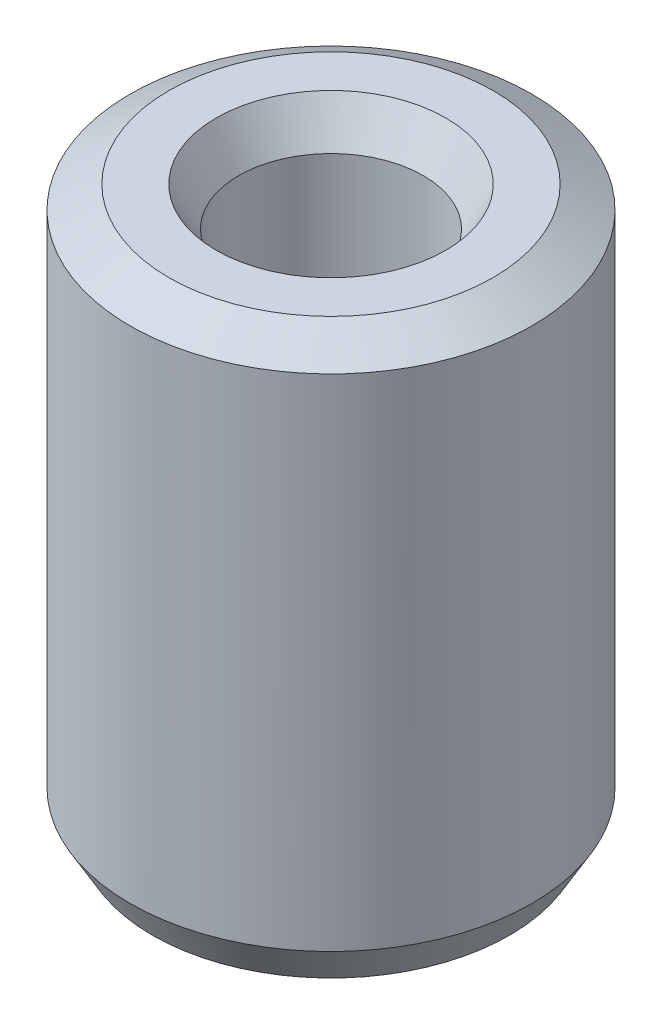
ISO-10303-21;
HEADER;
FILE_DESCRIPTION(('STEP AP214'),'2;1');
FILE_NAME('part.step','',(''),(''),'','','');
FILE_SCHEMA(('AUTOMOTIVE_DESIGN { 1 0 10303 214 1 1 1 1 }'));
ENDSEC;
DATA;
#1=APPLICATION_CONTEXT('core data for automotive mechanical design processes');
#2=APPLICATION_PROTOCOL_DEFINITION('international standard','automotive_design',2000,#1);
#3=PRODUCT_CONTEXT('',#1,'mechanical');
#4=PRODUCT('Part','Part','',(#3));
#5=PRODUCT_RELATED_PRODUCT_CATEGORY('part','',(#4));
#6=PRODUCT_DEFINITION_FORMATION('','',#4);
#7=PRODUCT_DEFINITION_CONTEXT('part definition',#1,'design');
#8=PRODUCT_DEFINITION('design','',#6,#7);
#9=PRODUCT_DEFINITION_SHAPE('','',#8);
#10=(LENGTH_UNIT() NAMED_UNIT(*) SI_UNIT(.MILLI.,.METRE.));
#11=(NAMED_UNIT(*) PLANE_ANGLE_UNIT() SI_UNIT($,.RADIAN.));
#12=(NAMED_UNIT(*) SI_UNIT($,.STERADIAN.) SOLID_ANGLE_UNIT());
#13=UNCERTAINTY_MEASURE_WITH_UNIT(LENGTH_MEASURE(1.E-05),#10,'distance_accuracy_value','');
#14=(GEOMETRIC_REPRESENTATION_CONTEXT(3) GLOBAL_UNCERTAINTY_ASSIGNED_CONTEXT((#13)) GLOBAL_UNIT_ASSIGNED_CONTEXT((#10,
#11,#12)) REPRESENTATION_CONTEXT('',''));
#15=CARTESIAN_POINT('',(0.,0.,0.));
#16=DIRECTION('',(0.,0.,1.));
#17=DIRECTION('',(1.,0.,0.));
#18=AXIS2_PLACEMENT_3D('',#15,#16,#17);
#19=CARTESIAN_POINT('',(0.,55.9058764466057,0.));
#20=DIRECTION('',(0.,-1.,0.));
#21=DIRECTION('',(0.,0.,-1.));
#22=AXIS2_PLACEMENT_3D('',#19,#20,#21);
#23=CYLINDRICAL_SURFACE('',#22,20.);
#24=CARTESIAN_POINT('',(0.,3.86379041157737,0.));
#25=DIRECTION('',(0.,1.,0.));
#26=DIRECTION('',(0.,0.,1.));
#27=AXIS2_PLACEMENT_3D('',#24,#25,#26);
#28=CIRCLE('',#27,20.);
#29=CARTESIAN_POINT('',(0.,3.86379041157737,-20.));
#30=VERTEX_POINT('',#29);
#31=EDGE_CURVE('E10',#30,#30,#28,.T.);
#32=CARTESIAN_POINT('',(0.,53.6751160123893,0.));
#33=DIRECTION('',(0.,1.,0.));
#34=DIRECTION('',(0.,0.,1.));
#35=AXIS2_PLACEMENT_3D('',#32,#33,#34);
#36=CIRCLE('',#35,20.);
#37=CARTESIAN_POINT('',(0.,53.6751160123893,-20.));
#38=VERTEX_POINT('',#37);
#39=EDGE_CURVE('E50',#38,#38,#36,.F.);
#40=CARTESIAN_POINT('',(0.,3.86379041157737,-20.));
#41=CARTESIAN_POINT('',(0.,4.38265838658582,-20.));
#42=CARTESIAN_POINT('',(0.,4.90152636159428,-20.));
#43=CARTESIAN_POINT('',(0.,5.9392623116112,-20.));
#44=CARTESIAN_POINT('',(0.,6.45813028661966,-20.));
#45=CARTESIAN_POINT('',(0.,7.49586623663657,-20.));
#46=CARTESIAN_POINT('',(0.,8.01473421164503,-20.));
#47=CARTESIAN_POINT('',(0.,9.05247016166194,-20.));
#48=CARTESIAN_POINT('',(0.,9.5713381366704,-20.));
#49=CARTESIAN_POINT('',(0.,10.6090740866873,-20.));
#50=CARTESIAN_POINT('',(0.,11.1279420616958,-20.));
#51=CARTESIAN_POINT('',(0.,12.1656780117127,-20.));
#52=CARTESIAN_POINT('',(0.,12.6845459867211,-20.));
#53=CARTESIAN_POINT('',(0.,13.7222819367381,-20.));
#54=CARTESIAN_POINT('',(0.,14.2411499117465,-20.));
#55=CARTESIAN_POINT('',(0.,15.2788858617634,-20.));
#56=CARTESIAN_POINT('',(0.,15.7977538367719,-20.));
#57=CARTESIAN_POINT('',(0.,16.8354897867888,-20.));
#58=CARTESIAN_POINT('',(0.,17.3543577617973,-20.));
#59=CARTESIAN_POINT('',(0.,18.3920937118142,-20.));
#60=CARTESIAN_POINT('',(0.,18.9109616868226,-20.));
#61=CARTESIAN_POINT('',(0.,19.9486976368395,-20.));
#62=CARTESIAN_POINT('',(0.,20.467565611848,-20.));
#63=CARTESIAN_POINT('',(0.,21.5053015618649,-20.));
#64=CARTESIAN_POINT('',(0.,22.0241695368734,-20.));
#65=CARTESIAN_POINT('',(0.,23.0619054868903,-20.));
#66=CARTESIAN_POINT('',(0.,23.5807734618987,-20.));
#67=CARTESIAN_POINT('',(0.,24.6185094119157,-20.));
#68=CARTESIAN_POINT('',(0.,25.1373773869241,-20.));
#69=CARTESIAN_POINT('',(0.,26.175113336941,-20.));
#70=CARTESIAN_POINT('',(0.,26.6939813119495,-20.));
#71=CARTESIAN_POINT('',(0.,27.7317172619664,-20.));
#72=CARTESIAN_POINT('',(0.,28.2505852369748,-20.));
#73=CARTESIAN_POINT('',(0.,29.2883211869918,-20.));
#74=CARTESIAN_POINT('',(0.,29.8071891620002,-20.));
#75=CARTESIAN_POINT('',(0.,30.8449251120171,-20.));
#76=CARTESIAN_POINT('',(0.,31.3637930870256,-20.));
#77=CARTESIAN_POINT('',(0.,32.4015290370425,-20.));
#78=CARTESIAN_POINT('',(0.,32.920397012051,-20.));
#79=CARTESIAN_POINT('',(0.,33.9581329620679,-20.));
#80=CARTESIAN_POINT('',(0.,34.4770009370763,-20.));
#81=CARTESIAN_POINT('',(0.,35.5147368870932,-20.));
#82=CARTESIAN_POINT('',(0.,36.0336048621017,-20.));
#83=CARTESIAN_POINT('',(0.,37.0713408121186,-20.));
#84=CARTESIAN_POINT('',(0.,37.5902087871271,-20.));
#85=CARTESIAN_POINT('',(0.,38.627944737144,-20.));
#86=CARTESIAN_POINT('',(0.,39.1468127121525,-20.));
#87=CARTESIAN_POINT('',(0.,40.1845486621694,-20.));
#88=CARTESIAN_POINT('',(0.,40.7034166371778,-20.));
#89=CARTESIAN_POINT('',(0.,41.7411525871947,-20.));
#90=CARTESIAN_POINT('',(0.,42.2600205622032,-20.));
#91=CARTESIAN_POINT('',(0.,43.2977565122201,-20.));
#92=CARTESIAN_POINT('',(0.,43.8166244872286,-20.));
#93=CARTESIAN_POINT('',(0.,44.8543604372455,-20.));
#94=CARTESIAN_POINT('',(0.,45.3732284122539,-20.));
#95=CARTESIAN_POINT('',(0.,46.4109643622709,-20.));
#96=CARTESIAN_POINT('',(0.,46.9298323372793,-20.));
#97=CARTESIAN_POINT('',(0.,47.9675682872962,-20.));
#98=CARTESIAN_POINT('',(0.,48.4864362623047,-20.));
#99=CARTESIAN_POINT('',(0.,49.5241722123216,-20.));
#100=CARTESIAN_POINT('',(0.,50.04304018733,-20.));
#101=CARTESIAN_POINT('',(0.,51.080776137347,-20.));
#102=CARTESIAN_POINT('',(0.,51.5996441123554,-20.));
#103=CARTESIAN_POINT('',(0.,52.6373800623723,-20.));
#104=CARTESIAN_POINT('',(0.,53.1562480373808,-20.));
#105=CARTESIAN_POINT('',(0.,53.6751160123893,-20.));
#106=B_SPLINE_CURVE_WITH_KNOTS('',3,(#40,#41,#42,#43,#44,#45,#46,#47,#48,#49,#50,#51,#52,#53,
#54,#55,#56,#57,#58,#59,#60,#61,#62,#63,#64,#65,#66,#67,#68,#69,#70,#71,#72,#73,#74,#75,#76,#77,
#78,#79,#80,#81,#82,#83,#84,#85,#86,#87,#88,#89,#90,#91,#92,#93,#94,#95,#96,#97,#98,#99,#100,
#101,#102,#103,#104,#105),.UNSPECIFIED.,.F.,.F.,(4,2,2,2,2,2,2,2,2,2,2,2,2,2,2,2,2,2,2,2,2,2,2,
2,2,2,2,2,2,2,2,2,4),(0.,1.55660392502537,3.11320785005074,4.66981177507612,6.22641570010149,
7.78301962512686,9.33962355015223,10.8962274751776,12.452831400203,14.0094353252283,
15.5660392502537,17.1226431752791,18.6792471003045,20.2358510253298,21.7924549503552,
23.3490588753806,24.9056628004059,26.4622667254313,28.0188706504567,29.5754745754821,
31.1320785005074,32.6886824255328,34.2452863505582,35.8018902755835,37.3584942006089,
38.9150981256343,40.4717020506597,42.028305975685,43.5849099007104,45.1415138257358,
46.6981177507611,48.2547216757865,49.8113256008119),.UNSPECIFIED.);
#107=EDGE_CURVE('BSEAM39',#30,#38,#106,.T.);
#108=ORIENTED_EDGE('',*,*,#31,.T.);
#109=ORIENTED_EDGE('',*,*,#39,.T.);
#110=ORIENTED_EDGE('',*,*,#107,.T.);
#111=ORIENTED_EDGE('',*,*,#107,.F.);
#112=EDGE_LOOP('',(#108,#110,#109,#111));
#113=FACE_BOUND('',#112,.T.);
#114=ADVANCED_FACE('F39',(#113),#23,.T.);
#115=CARTESIAN_POINT('',(0.,55.9058764466057,0.));
#116=DIRECTION('',(0.,1.,0.));
#117=DIRECTION('',(0.,0.,1.));
#118=AXIS2_PLACEMENT_3D('',#115,#116,#117);
#119=PLANE('',#118);
#120=CARTESIAN_POINT('',(0.,55.9058764466057,0.));
#121=DIRECTION('',(0.,1.,0.));
#122=DIRECTION('',(0.,0.,1.));
#123=AXIS2_PLACEMENT_3D('',#120,#121,#122);
#124=CIRCLE('',#123,11.4265105615015);
#125=CARTESIAN_POINT('',(0.,55.9058764466057,11.4265105615015));
#126=VERTEX_POINT('',#125);
#127=EDGE_CURVE('E58',#126,#126,#124,.F.);
#128=ORIENTED_EDGE('',*,*,#127,.T.);
#129=EDGE_LOOP('',(#128));
#130=FACE_BOUND('',#129,.T.);
#131=CARTESIAN_POINT('',(0.,55.9058764466057,0.));
#132=DIRECTION('',(0.,1.,0.));
#133=DIRECTION('',(0.,0.,1.));
#134=AXIS2_PLACEMENT_3D('',#131,#132,#133);
#135=CIRCLE('',#134,16.1362095884228);
#136=CARTESIAN_POINT('',(0.,55.9058764466057,16.1362095884228));
#137=VERTEX_POINT('',#136);
#138=EDGE_CURVE('E61',#137,#137,#135,.T.);
#139=ORIENTED_EDGE('',*,*,#138,.T.);
#140=EDGE_LOOP('',(#139));
#141=FACE_BOUND('',#140,.T.);
#142=ADVANCED_FACE('F88',(#130,#141),#119,.T.);
#143=CARTESIAN_POINT('',(0.,0.,0.));
#144=DIRECTION('',(0.,1.,0.));
#145=DIRECTION('',(0.,0.,1.));
#146=AXIS2_PLACEMENT_3D('',#143,#144,#145);
#147=PLANE('',#146);
#148=CARTESIAN_POINT('',(0.,0.,0.));
#149=DIRECTION('',(0.,1.,0.));
#150=DIRECTION('',(0.,0.,1.));
#151=AXIS2_PLACEMENT_3D('',#148,#149,#150);
#152=CIRCLE('',#151,13.0595405388623);
#153=CARTESIAN_POINT('',(0.,0.,13.0595405388623));
#154=VERTEX_POINT('',#153);
#155=EDGE_CURVE('E51',#154,#154,#152,.T.);
#156=ORIENTED_EDGE('',*,*,#155,.T.);
#157=EDGE_LOOP('',(#156));
#158=FACE_BOUND('',#157,.T.);
#159=CARTESIAN_POINT('',(0.,0.,0.));
#160=DIRECTION('',(0.,1.,0.));
#161=DIRECTION('',(0.,0.,1.));
#162=AXIS2_PLACEMENT_3D('',#159,#160,#161);
#163=CIRCLE('',#162,17.7692395657835);
#164=CARTESIAN_POINT('',(0.,0.,17.7692395657835));
#165=VERTEX_POINT('',#164);
#166=EDGE_CURVE('E54',#165,#165,#163,.F.);
#167=ORIENTED_EDGE('',*,*,#166,.T.);
#168=EDGE_LOOP('',(#167));
#169=FACE_BOUND('',#168,.T.);
#170=ADVANCED_FACE('F83',(#158,#169),#147,.F.);
#171=CARTESIAN_POINT('',(0.,55.9058764466057,0.));
#172=DIRECTION('',(0.,-1.,0.));
#173=DIRECTION('',(0.,0.,-1.));
#174=AXIS2_PLACEMENT_3D('',#171,#172,#173);
#175=CYLINDRICAL_SURFACE('',#174,9.19575012728503);
#176=CARTESIAN_POINT('',(0.,52.0420860350283,0.));
#177=DIRECTION('',(0.,1.,0.));
#178=DIRECTION('',(0.,0.,1.));
#179=AXIS2_PLACEMENT_3D('',#176,#177,#178);
#180=CIRCLE('',#179,9.19575012728503);
#181=CARTESIAN_POINT('',(0.,52.0420860350283,-9.19575012728503));
#182=VERTEX_POINT('',#181);
#183=EDGE_CURVE('E67',#182,#182,#180,.T.);
#184=CARTESIAN_POINT('',(0.,2.23076043421643,0.));
#185=DIRECTION('',(0.,1.,0.));
#186=DIRECTION('',(0.,0.,1.));
#187=AXIS2_PLACEMENT_3D('',#184,#185,#186);
#188=CIRCLE('',#187,9.19575012728503);
#189=CARTESIAN_POINT('',(0.,2.23076043421642,-9.19575012728503));
#190=VERTEX_POINT('',#189);
#191=EDGE_CURVE('E69',#190,#190,#188,.F.);
#192=CARTESIAN_POINT('',(0.,52.0420860350283,-9.19575012728503));
#193=CARTESIAN_POINT('',(0.,51.5232180600199,-9.19575012728503));
#194=CARTESIAN_POINT('',(0.,51.0043500850114,-9.19575012728503));
#195=CARTESIAN_POINT('',(0.,49.9666141349945,-9.19575012728503));
#196=CARTESIAN_POINT('',(0.,49.447746159986,-9.19575012728503));
#197=CARTESIAN_POINT('',(0.,48.4100102099691,-9.19575012728503));
#198=CARTESIAN_POINT('',(0.,47.8911422349607,-9.19575012728503));
#199=CARTESIAN_POINT('',(0.,46.8534062849438,-9.19575012728503));
#200=CARTESIAN_POINT('',(0.,46.3345383099353,-9.19575012728503));
#201=CARTESIAN_POINT('',(0.,45.2968023599184,-9.19575012728503));
#202=CARTESIAN_POINT('',(0.,44.7779343849099,-9.19575012728503));
#203=CARTESIAN_POINT('',(0.,43.740198434893,-9.19575012728503));
#204=CARTESIAN_POINT('',(0.,43.2213304598845,-9.19575012728503));
#205=CARTESIAN_POINT('',(0.,42.1835945098676,-9.19575012728503));
#206=CARTESIAN_POINT('',(0.,41.6647265348592,-9.19575012728503));
#207=CARTESIAN_POINT('',(0.,40.6269905848423,-9.19575012728503));
#208=CARTESIAN_POINT('',(0.,40.1081226098338,-9.19575012728503));
#209=CARTESIAN_POINT('',(0.,39.0703866598169,-9.19575012728503));
#210=CARTESIAN_POINT('',(0.,38.5515186848084,-9.19575012728503));
#211=CARTESIAN_POINT('',(0.,37.5137827347915,-9.19575012728503));
#212=CARTESIAN_POINT('',(0.,36.9949147597831,-9.19575012728503));
#213=CARTESIAN_POINT('',(0.,35.9571788097661,-9.19575012728503));
#214=CARTESIAN_POINT('',(0.,35.4383108347577,-9.19575012728503));
#215=CARTESIAN_POINT('',(0.,34.4005748847408,-9.19575012728503));
#216=CARTESIAN_POINT('',(0.,33.8817069097323,-9.19575012728503));
#217=CARTESIAN_POINT('',(0.,32.8439709597154,-9.19575012728503));
#218=CARTESIAN_POINT('',(0.,32.325102984707,-9.19575012728503));
#219=CARTESIAN_POINT('',(0.,31.28736703469,-9.19575012728503));
#220=CARTESIAN_POINT('',(0.,30.7684990596816,-9.19575012728503));
#221=CARTESIAN_POINT('',(0.,29.7307631096647,-9.19575012728503));
#222=CARTESIAN_POINT('',(0.,29.2118951346562,-9.19575012728503));
#223=CARTESIAN_POINT('',(0.,28.1741591846393,-9.19575012728503));
#224=CARTESIAN_POINT('',(0.,27.6552912096308,-9.19575012728503));
#225=CARTESIAN_POINT('',(0.,26.6175552596139,-9.19575012728503));
#226=CARTESIAN_POINT('',(0.,26.0986872846055,-9.19575012728503));
#227=CARTESIAN_POINT('',(0.,25.0609513345885,-9.19575012728503));
#228=CARTESIAN_POINT('',(0.,24.5420833595801,-9.19575012728503));
#229=CARTESIAN_POINT('',(0.,23.5043474095632,-9.19575012728503));
#230=CARTESIAN_POINT('',(0.,22.9854794345547,-9.19575012728503));
#231=CARTESIAN_POINT('',(0.,21.9477434845378,-9.19575012728503));
#232=CARTESIAN_POINT('',(0.,21.4288755095293,-9.19575012728503));
#233=CARTESIAN_POINT('',(0.,20.3911395595124,-9.19575012728503));
#234=CARTESIAN_POINT('',(0.,19.872271584504,-9.19575012728503));
#235=CARTESIAN_POINT('',(0.,18.8345356344871,-9.19575012728503));
#236=CARTESIAN_POINT('',(0.,18.3156676594786,-9.19575012728503));
#237=CARTESIAN_POINT('',(0.,17.2779317094617,-9.19575012728503));
#238=CARTESIAN_POINT('',(0.,16.7590637344532,-9.19575012728503));
#239=CARTESIAN_POINT('',(0.,15.7213277844363,-9.19575012728503));
#240=CARTESIAN_POINT('',(0.,15.2024598094279,-9.19575012728503));
#241=CARTESIAN_POINT('',(0.,14.1647238594109,-9.19575012728503));
#242=CARTESIAN_POINT('',(0.,13.6458558844025,-9.19575012728503));
#243=CARTESIAN_POINT('',(0.,12.6081199343856,-9.19575012728503));
#244=CARTESIAN_POINT('',(0.,12.0892519593771,-9.19575012728503));
#245=CARTESIAN_POINT('',(0.,11.0515160093602,-9.19575012728503));
#246=CARTESIAN_POINT('',(0.,10.5326480343517,-9.19575012728503));
#247=CARTESIAN_POINT('',(0.,9.49491208433482,-9.19575012728503));
#248=CARTESIAN_POINT('',(0.,8.97604410932636,-9.19575012728503));
#249=CARTESIAN_POINT('',(0.,7.93830815930945,-9.19575012728503));
#250=CARTESIAN_POINT('',(0.,7.41944018430099,-9.19575012728503));
#251=CARTESIAN_POINT('',(0.,6.38170423428408,-9.19575012728503));
#252=CARTESIAN_POINT('',(0.,5.86283625927562,-9.19575012728503));
#253=CARTESIAN_POINT('',(0.,4.8251003092587,-9.19575012728503));
#254=CARTESIAN_POINT('',(0.,4.30623233425025,-9.19575012728503));
#255=CARTESIAN_POINT('',(0.,3.26849638423333,-9.19575012728503));
#256=CARTESIAN_POINT('',(0.,2.74962840922487,-9.19575012728503));
#257=CARTESIAN_POINT('',(0.,2.23076043421642,-9.19575012728503));
#258=B_SPLINE_CURVE_WITH_KNOTS('',3,(#192,#193,#194,#195,#196,#197,#198,#199,#200,#201,#202,
#203,#204,#205,#206,#207,#208,#209,#210,#211,#212,#213,#214,#215,#216,#217,#218,#219,#220,#221,
#222,#223,#224,#225,#226,#227,#228,#229,#230,#231,#232,#233,#234,#235,#236,#237,#238,#239,#240,
#241,#242,#243,#244,#245,#246,#247,#248,#249,#250,#251,#252,#253,#254,#255,#256,#257),
.UNSPECIFIED.,.F.,.F.,(4,2,2,2,2,2,2,2,2,2,2,2,2,2,2,2,2,2,2,2,2,2,2,2,2,2,2,2,2,2,2,2,4),(0.,
1.55660392502537,3.11320785005074,4.66981177507611,6.22641570010148,7.78301962512686,
9.33962355015223,10.8962274751776,12.452831400203,14.0094353252283,15.5660392502537,
17.1226431752791,18.6792471003045,20.2358510253298,21.7924549503552,23.3490588753806,
24.9056628004059,26.4622667254313,28.0188706504567,29.5754745754821,31.1320785005074,
32.6886824255328,34.2452863505582,35.8018902755836,37.3584942006089,38.9150981256343,
40.4717020506597,42.028305975685,43.5849099007104,45.1415138257358,46.6981177507612,
48.2547216757865,49.8113256008119),.UNSPECIFIED.);
#259=EDGE_CURVE('BSEAM71',#182,#190,#258,.T.);
#260=ORIENTED_EDGE('',*,*,#183,.T.);
#261=ORIENTED_EDGE('',*,*,#191,.T.);
#262=ORIENTED_EDGE('',*,*,#259,.T.);
#263=ORIENTED_EDGE('',*,*,#259,.F.);
#264=EDGE_LOOP('',(#260,#262,#261,#263));
#265=FACE_BOUND('',#264,.T.);
#266=ADVANCED_FACE('F71',(#265),#175,.F.);
#267=CARTESIAN_POINT('',(0.,52.0420860350283,0.));
#268=DIRECTION('',(0.,1.,0.));
#269=DIRECTION('',(0.,0.,1.));
#270=AXIS2_PLACEMENT_3D('',#267,#268,#269);
#271=CONICAL_SURFACE('',#270,9.19575012728503,0.523598775598301);
#272=ORIENTED_EDGE('',*,*,#127,.F.);
#273=EDGE_LOOP('',(#272));
#274=FACE_BOUND('',#273,.T.);
#275=ORIENTED_EDGE('',*,*,#183,.F.);
#276=EDGE_LOOP('',(#275));
#277=FACE_BOUND('',#276,.T.);
#278=ADVANCED_FACE('F77',(#274,#277),#271,.F.);
#279=CARTESIAN_POINT('',(0.,0.,0.));
#280=DIRECTION('',(0.,-1.,0.));
#281=DIRECTION('',(0.,0.,-1.));
#282=AXIS2_PLACEMENT_3D('',#279,#280,#281);
#283=CONICAL_SURFACE('',#282,13.0595405388623,1.04719755119659);
#284=ORIENTED_EDGE('',*,*,#191,.F.);
#285=EDGE_LOOP('',(#284));
#286=FACE_BOUND('',#285,.T.);
#287=ORIENTED_EDGE('',*,*,#155,.F.);
#288=EDGE_LOOP('',(#287));
#289=FACE_BOUND('',#288,.T.);
#290=ADVANCED_FACE('F73',(#286,#289),#283,.F.);
#291=CARTESIAN_POINT('',(0.,3.86379041157737,0.));
#292=DIRECTION('',(0.,1.,0.));
#293=DIRECTION('',(0.,0.,1.));
#294=AXIS2_PLACEMENT_3D('',#291,#292,#293);
#295=CONICAL_SURFACE('',#294,20.,0.523598775598302);
#296=ORIENTED_EDGE('',*,*,#166,.F.);
#297=EDGE_LOOP('',(#296));
#298=FACE_BOUND('',#297,.T.);
#299=ORIENTED_EDGE('',*,*,#31,.F.);
#300=EDGE_LOOP('',(#299));
#301=FACE_BOUND('',#300,.T.);
#302=ADVANCED_FACE('F76',(#298,#301),#295,.T.);
#303=CARTESIAN_POINT('',(0.,55.9058764466057,0.));
#304=DIRECTION('',(0.,-1.,0.));
#305=DIRECTION('',(0.,0.,-1.));
#306=AXIS2_PLACEMENT_3D('',#303,#304,#305);
#307=CONICAL_SURFACE('',#306,16.1362095884228,1.04719755119659);
#308=ORIENTED_EDGE('',*,*,#39,.F.);
#309=EDGE_LOOP('',(#308));
#310=FACE_BOUND('',#309,.T.);
#311=ORIENTED_EDGE('',*,*,#138,.F.);
#312=EDGE_LOOP('',(#311));
#313=FACE_BOUND('',#312,.T.);
#314=ADVANCED_FACE('F45',(#310,#313),#307,.T.);
#315=CLOSED_SHELL('',(#114,#142,#170,#266,#278,#290,#302,#314));
#316=MANIFOLD_SOLID_BREP('B2',#315);
#317=ADVANCED_BREP_SHAPE_REPRESENTATION('',(#18,#316),#14);
#318=SHAPE_DEFINITION_REPRESENTATION(#9,#317);
ENDSEC;
END-ISO-10303-21;
